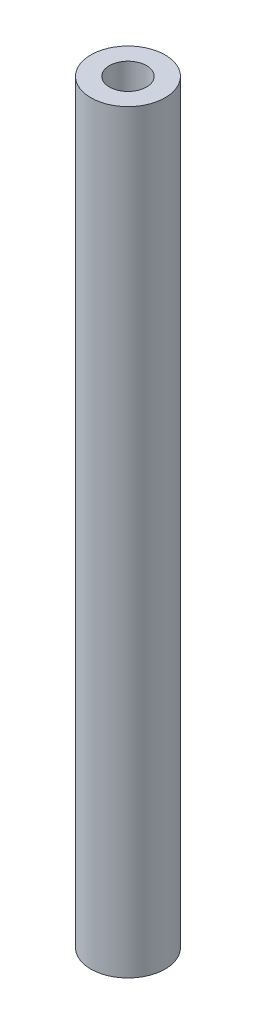
ISO-10303-21;
HEADER;
FILE_DESCRIPTION(('STEP AP214'),'2;1');
FILE_NAME('part.step','',(''),(''),'','','');
FILE_SCHEMA(('AUTOMOTIVE_DESIGN { 1 0 10303 214 1 1 1 1 }'));
ENDSEC;
DATA;
#1=APPLICATION_CONTEXT('core data for automotive mechanical design processes');
#2=APPLICATION_PROTOCOL_DEFINITION('international standard','automotive_design',2000,#1);
#3=PRODUCT_CONTEXT('',#1,'mechanical');
#4=PRODUCT('Part','Part','',(#3));
#5=PRODUCT_RELATED_PRODUCT_CATEGORY('part','',(#4));
#6=PRODUCT_DEFINITION_FORMATION('','',#4);
#7=PRODUCT_DEFINITION_CONTEXT('part definition',#1,'design');
#8=PRODUCT_DEFINITION('design','',#6,#7);
#9=PRODUCT_DEFINITION_SHAPE('','',#8);
#10=(LENGTH_UNIT() NAMED_UNIT(*) SI_UNIT(.MILLI.,.METRE.));
#11=(NAMED_UNIT(*) PLANE_ANGLE_UNIT() SI_UNIT($,.RADIAN.));
#12=(NAMED_UNIT(*) SI_UNIT($,.STERADIAN.) SOLID_ANGLE_UNIT());
#13=UNCERTAINTY_MEASURE_WITH_UNIT(LENGTH_MEASURE(1.E-05),#10,'distance_accuracy_value','');
#14=(GEOMETRIC_REPRESENTATION_CONTEXT(3) GLOBAL_UNCERTAINTY_ASSIGNED_CONTEXT((#13)) GLOBAL_UNIT_ASSIGNED_CONTEXT((#10,
#11,#12)) REPRESENTATION_CONTEXT('',''));
#15=CARTESIAN_POINT('',(0.,0.,0.));
#16=DIRECTION('',(0.,0.,1.));
#17=DIRECTION('',(1.,0.,0.));
#18=AXIS2_PLACEMENT_3D('',#15,#16,#17);
#19=CARTESIAN_POINT('',(0.,101.6,0.));
#20=DIRECTION('',(0.,-1.,0.));
#21=DIRECTION('',(0.,0.,-1.));
#22=AXIS2_PLACEMENT_3D('',#19,#20,#21);
#23=CYLINDRICAL_SURFACE('',#22,5.);
#24=CARTESIAN_POINT('',(0.,101.6,0.));
#25=DIRECTION('',(0.,1.,0.));
#26=DIRECTION('',(0.,0.,1.));
#27=AXIS2_PLACEMENT_3D('',#24,#25,#26);
#28=CIRCLE('',#27,5.);
#29=CARTESIAN_POINT('',(0.,101.6,5.));
#30=VERTEX_POINT('',#29);
#31=EDGE_CURVE('E10',#30,#30,#28,.T.);
#32=ORIENTED_EDGE('',*,*,#31,.F.);
#33=EDGE_LOOP('',(#32));
#34=FACE_BOUND('',#33,.T.);
#35=CARTESIAN_POINT('',(0.,0.,0.));
#36=DIRECTION('',(0.,1.,0.));
#37=DIRECTION('',(0.,0.,1.));
#38=AXIS2_PLACEMENT_3D('',#35,#36,#37);
#39=CIRCLE('',#38,5.);
#40=CARTESIAN_POINT('',(0.,0.,5.));
#41=VERTEX_POINT('',#40);
#42=EDGE_CURVE('E42',#41,#41,#39,.T.);
#43=ORIENTED_EDGE('',*,*,#42,.T.);
#44=EDGE_LOOP('',(#43));
#45=FACE_BOUND('',#44,.T.);
#46=ADVANCED_FACE('F39',(#34,#45),#23,.T.);
#47=CARTESIAN_POINT('',(0.,101.6,0.));
#48=DIRECTION('',(0.,1.,0.));
#49=DIRECTION('',(0.,0.,1.));
#50=AXIS2_PLACEMENT_3D('',#47,#48,#49);
#51=PLANE('',#50);
#52=CARTESIAN_POINT('',(0.,101.6,0.));
#53=DIRECTION('',(0.,-1.,0.));
#54=DIRECTION('',(0.,0.,-1.));
#55=AXIS2_PLACEMENT_3D('',#52,#53,#54);
#56=CIRCLE('',#55,2.49999999999998);
#57=CARTESIAN_POINT('',(0.,101.6,-2.49999999999998));
#58=VERTEX_POINT('',#57);
#59=EDGE_CURVE('E49',#58,#58,#56,.T.);
#60=ORIENTED_EDGE('',*,*,#59,.T.);
#61=EDGE_LOOP('',(#60));
#62=FACE_BOUND('',#61,.T.);
#63=ORIENTED_EDGE('',*,*,#31,.T.);
#64=EDGE_LOOP('',(#63));
#65=FACE_BOUND('',#64,.T.);
#66=ADVANCED_FACE('F66',(#62,#65),#51,.T.);
#67=CARTESIAN_POINT('',(0.,0.,0.));
#68=DIRECTION('',(0.,1.,0.));
#69=DIRECTION('',(0.,0.,1.));
#70=AXIS2_PLACEMENT_3D('',#67,#68,#69);
#71=PLANE('',#70);
#72=CARTESIAN_POINT('',(0.,0.,0.));
#73=DIRECTION('',(0.,-1.,0.));
#74=DIRECTION('',(0.,0.,-1.));
#75=AXIS2_PLACEMENT_3D('',#72,#73,#74);
#76=CIRCLE('',#75,3.025);
#77=CARTESIAN_POINT('',(0.,0.,-3.025));
#78=VERTEX_POINT('',#77);
#79=EDGE_CURVE('E56',#78,#78,#76,.T.);
#80=ORIENTED_EDGE('',*,*,#79,.F.);
#81=EDGE_LOOP('',(#80));
#82=FACE_BOUND('',#81,.T.);
#83=ORIENTED_EDGE('',*,*,#42,.F.);
#84=EDGE_LOOP('',(#83));
#85=FACE_BOUND('',#84,.T.);
#86=ADVANCED_FACE('F62',(#82,#85),#71,.F.);
#87=CARTESIAN_POINT('',(0.,0.,0.));
#88=DIRECTION('',(0.,-1.,0.));
#89=DIRECTION('',(0.,0.,-1.));
#90=AXIS2_PLACEMENT_3D('',#87,#88,#89);
#91=CYLINDRICAL_SURFACE('',#90,2.49999999999998);
#92=ORIENTED_EDGE('',*,*,#59,.F.);
#93=EDGE_LOOP('',(#92));
#94=FACE_BOUND('',#93,.T.);
#95=CARTESIAN_POINT('',(0.,0.525000000000025,0.));
#96=DIRECTION('',(0.,-1.,0.));
#97=DIRECTION('',(0.,0.,-1.));
#98=AXIS2_PLACEMENT_3D('',#95,#96,#97);
#99=CIRCLE('',#98,2.49999999999999);
#100=CARTESIAN_POINT('',(0.,0.525000000000025,-2.49999999999999));
#101=VERTEX_POINT('',#100);
#102=EDGE_CURVE('E53',#101,#101,#99,.T.);
#103=ORIENTED_EDGE('',*,*,#102,.T.);
#104=EDGE_LOOP('',(#103));
#105=FACE_BOUND('',#104,.T.);
#106=ADVANCED_FACE('F65',(#94,#105),#91,.F.);
#107=CARTESIAN_POINT('',(0.,0.,0.));
#108=DIRECTION('',(0.,-1.,0.));
#109=DIRECTION('',(0.,0.,-1.));
#110=AXIS2_PLACEMENT_3D('',#107,#108,#109);
#111=CONICAL_SURFACE('',#110,3.025,0.785398163397436);
#112=ORIENTED_EDGE('',*,*,#102,.F.);
#113=EDGE_LOOP('',(#112));
#114=FACE_BOUND('',#113,.T.);
#115=ORIENTED_EDGE('',*,*,#79,.T.);
#116=EDGE_LOOP('',(#115));
#117=FACE_BOUND('',#116,.T.);
#118=ADVANCED_FACE('F60',(#114,#117),#111,.F.);
#119=CLOSED_SHELL('',(#46,#66,#86,#106,#118));
#120=MANIFOLD_SOLID_BREP('B2',#119);
#121=ADVANCED_BREP_SHAPE_REPRESENTATION('',(#18,#120),#14);
#122=SHAPE_DEFINITION_REPRESENTATION(#9,#121);
ENDSEC;
END-ISO-10303-21;
